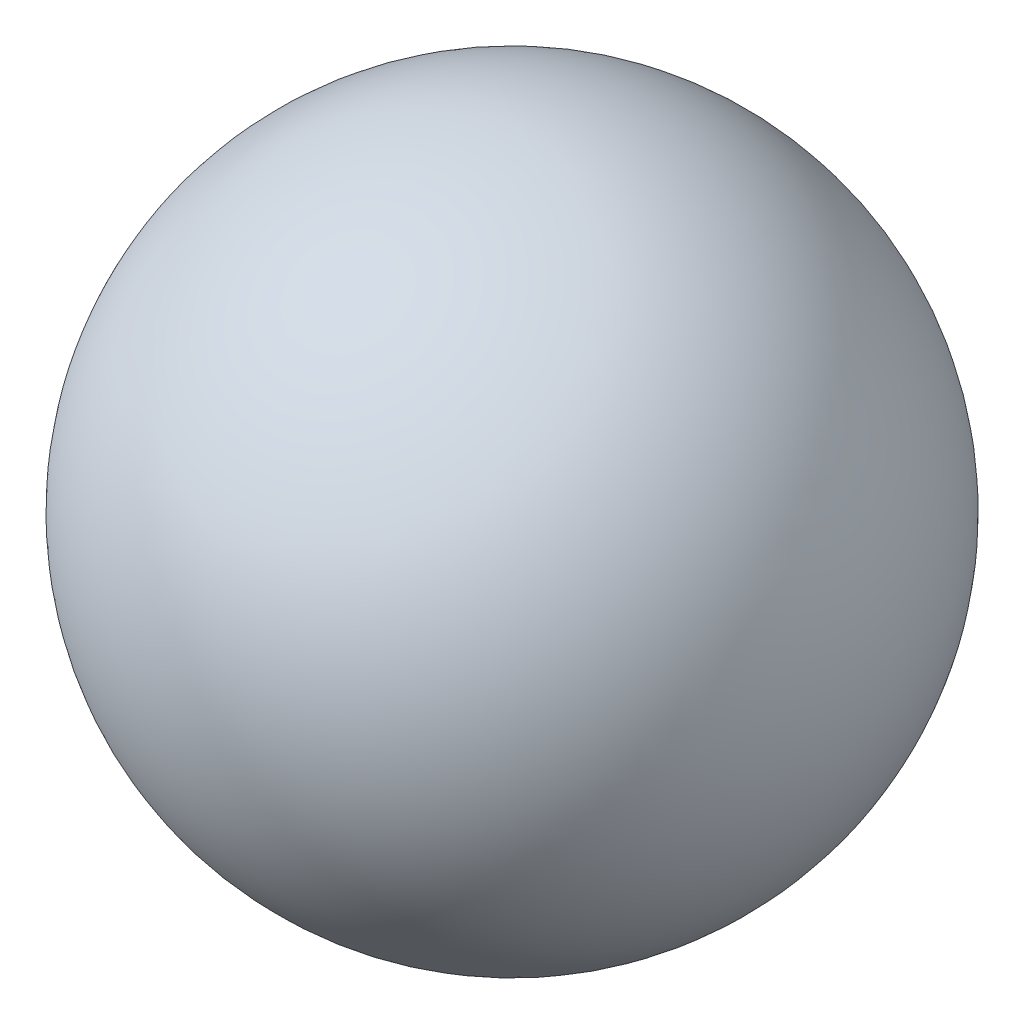
ISO-10303-21;
HEADER;
FILE_DESCRIPTION(('STEP AP214'),'2;1');
FILE_NAME('part.step','',(''),(''),'','','');
FILE_SCHEMA(('AUTOMOTIVE_DESIGN { 1 0 10303 214 1 1 1 1 }'));
ENDSEC;
DATA;
#1=APPLICATION_CONTEXT('core data for automotive mechanical design processes');
#2=APPLICATION_PROTOCOL_DEFINITION('international standard','automotive_design',2000,#1);
#3=PRODUCT_CONTEXT('',#1,'mechanical');
#4=PRODUCT('Part','Part','',(#3));
#5=PRODUCT_RELATED_PRODUCT_CATEGORY('part','',(#4));
#6=PRODUCT_DEFINITION_FORMATION('','',#4);
#7=PRODUCT_DEFINITION_CONTEXT('part definition',#1,'design');
#8=PRODUCT_DEFINITION('design','',#6,#7);
#9=PRODUCT_DEFINITION_SHAPE('','',#8);
#10=(LENGTH_UNIT() NAMED_UNIT(*) SI_UNIT(.MILLI.,.METRE.));
#11=(NAMED_UNIT(*) PLANE_ANGLE_UNIT() SI_UNIT($,.RADIAN.));
#12=(NAMED_UNIT(*) SI_UNIT($,.STERADIAN.) SOLID_ANGLE_UNIT());
#13=UNCERTAINTY_MEASURE_WITH_UNIT(LENGTH_MEASURE(1.E-05),#10,'distance_accuracy_value','');
#14=(GEOMETRIC_REPRESENTATION_CONTEXT(3) GLOBAL_UNCERTAINTY_ASSIGNED_CONTEXT((#13)) GLOBAL_UNIT_ASSIGNED_CONTEXT((#10,
#11,#12)) REPRESENTATION_CONTEXT('',''));
#15=CARTESIAN_POINT('',(0.,0.,0.));
#16=DIRECTION('',(0.,0.,1.));
#17=DIRECTION('',(1.,0.,0.));
#18=AXIS2_PLACEMENT_3D('',#15,#16,#17);
#19=CARTESIAN_POINT('',(0.,0.,0.));
#20=DIRECTION('',(1.,0.,0.));
#21=DIRECTION('',(0.,-1.,0.));
#22=AXIS2_PLACEMENT_3D('',#19,#20,#21);
#23=SPHERICAL_SURFACE('',#22,0.28);
#24=CARTESIAN_POINT('',(0.28,0.,0.));
#25=VERTEX_POINT('',#24);
#26=VERTEX_LOOP('',#25);
#27=FACE_BOUND('',#26,.T.);
#28=ADVANCED_FACE('F31',(#27),#23,.T.);
#29=CLOSED_SHELL('',(#28));
#30=MANIFOLD_SOLID_BREP('B2',#29);
#31=ADVANCED_BREP_SHAPE_REPRESENTATION('',(#18,#30),#14);
#32=SHAPE_DEFINITION_REPRESENTATION(#9,#31);
ENDSEC;
END-ISO-10303-21;
